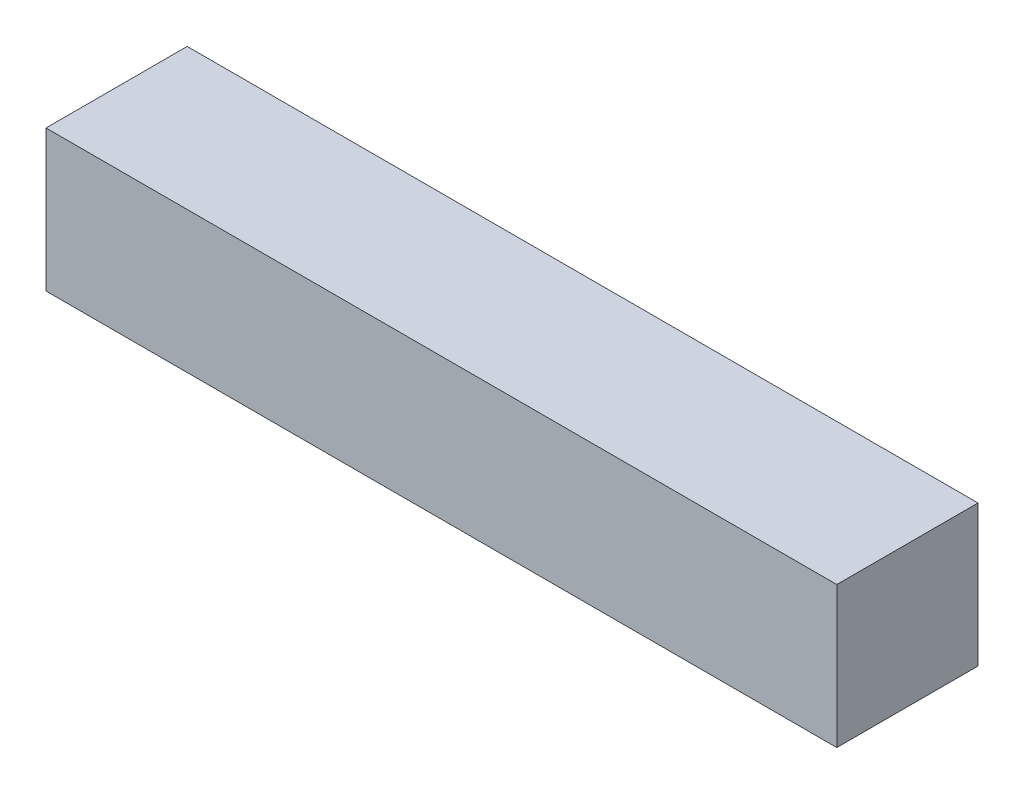
ISO-10303-21;
HEADER;
FILE_DESCRIPTION(('STEP AP214'),'2;1');
FILE_NAME('part.step','',(''),(''),'','','');
FILE_SCHEMA(('AUTOMOTIVE_DESIGN { 1 0 10303 214 1 1 1 1 }'));
ENDSEC;
DATA;
#1=APPLICATION_CONTEXT('core data for automotive mechanical design processes');
#2=APPLICATION_PROTOCOL_DEFINITION('international standard','automotive_design',2000,#1);
#3=PRODUCT_CONTEXT('',#1,'mechanical');
#4=PRODUCT('Part','Part','',(#3));
#5=PRODUCT_RELATED_PRODUCT_CATEGORY('part','',(#4));
#6=PRODUCT_DEFINITION_FORMATION('','',#4);
#7=PRODUCT_DEFINITION_CONTEXT('part definition',#1,'design');
#8=PRODUCT_DEFINITION('design','',#6,#7);
#9=PRODUCT_DEFINITION_SHAPE('','',#8);
#10=(LENGTH_UNIT() NAMED_UNIT(*) SI_UNIT(.MILLI.,.METRE.));
#11=(NAMED_UNIT(*) PLANE_ANGLE_UNIT() SI_UNIT($,.RADIAN.));
#12=(NAMED_UNIT(*) SI_UNIT($,.STERADIAN.) SOLID_ANGLE_UNIT());
#13=UNCERTAINTY_MEASURE_WITH_UNIT(LENGTH_MEASURE(1.E-05),#10,'distance_accuracy_value','');
#14=(GEOMETRIC_REPRESENTATION_CONTEXT(3) GLOBAL_UNCERTAINTY_ASSIGNED_CONTEXT((#13)) GLOBAL_UNIT_ASSIGNED_CONTEXT((#10,
#11,#12)) REPRESENTATION_CONTEXT('',''));
#15=CARTESIAN_POINT('',(0.,0.,0.));
#16=DIRECTION('',(0.,0.,1.));
#17=DIRECTION('',(1.,0.,0.));
#18=AXIS2_PLACEMENT_3D('',#15,#16,#17);
#19=CARTESIAN_POINT('',(-70.,25.,12.5));
#20=DIRECTION('',(1.,0.,0.));
#21=DIRECTION('',(0.,0.,-1.));
#22=AXIS2_PLACEMENT_3D('',#19,#20,#21);
#23=PLANE('',#22);
#24=DIRECTION('',(0.,0.,1.));
#25=VECTOR('',#24,1.);
#26=CARTESIAN_POINT('',(-70.,0.,12.5));
#27=LINE('',#26,#25);
#28=CARTESIAN_POINT('',(-70.,0.,-12.5));
#29=VERTEX_POINT('',#28);
#30=CARTESIAN_POINT('',(-70.,0.,12.5));
#31=VERTEX_POINT('',#30);
#32=EDGE_CURVE('E96',#29,#31,#27,.T.);
#33=ORIENTED_EDGE('',*,*,#32,.T.);
#34=DIRECTION('',(0.,-1.,0.));
#35=VECTOR('',#34,1.);
#36=CARTESIAN_POINT('',(-70.,25.,12.5));
#37=LINE('',#36,#35);
#38=CARTESIAN_POINT('',(-70.,25.,12.5));
#39=VERTEX_POINT('',#38);
#40=EDGE_CURVE('E11',#39,#31,#37,.T.);
#41=ORIENTED_EDGE('',*,*,#40,.F.);
#42=DIRECTION('',(0.,0.,1.));
#43=VECTOR('',#42,1.);
#44=CARTESIAN_POINT('',(-70.,25.,12.5));
#45=LINE('',#44,#43);
#46=CARTESIAN_POINT('',(-70.,25.,-12.5));
#47=VERTEX_POINT('',#46);
#48=EDGE_CURVE('E84',#47,#39,#45,.T.);
#49=ORIENTED_EDGE('',*,*,#48,.F.);
#50=DIRECTION('',(0.,-1.,0.));
#51=VECTOR('',#50,1.);
#52=CARTESIAN_POINT('',(-70.,25.,-12.5));
#53=LINE('',#52,#51);
#54=EDGE_CURVE('E92',#47,#29,#53,.T.);
#55=ORIENTED_EDGE('',*,*,#54,.T.);
#56=EDGE_LOOP('',(#33,#41,#49,#55));
#57=FACE_BOUND('',#56,.T.);
#58=ADVANCED_FACE('F33',(#57),#23,.F.);
#59=CARTESIAN_POINT('',(70.,25.,12.5));
#60=DIRECTION('',(0.,0.,-1.));
#61=DIRECTION('',(-1.,0.,0.));
#62=AXIS2_PLACEMENT_3D('',#59,#60,#61);
#63=PLANE('',#62);
#64=DIRECTION('',(1.,0.,0.));
#65=VECTOR('',#64,1.);
#66=CARTESIAN_POINT('',(70.,0.,12.5));
#67=LINE('',#66,#65);
#68=CARTESIAN_POINT('',(70.,0.,12.5));
#69=VERTEX_POINT('',#68);
#70=EDGE_CURVE('E88',#31,#69,#67,.T.);
#71=ORIENTED_EDGE('',*,*,#70,.T.);
#72=DIRECTION('',(0.,-1.,0.));
#73=VECTOR('',#72,1.);
#74=CARTESIAN_POINT('',(70.,25.,12.5));
#75=LINE('',#74,#73);
#76=CARTESIAN_POINT('',(70.,25.,12.5));
#77=VERTEX_POINT('',#76);
#78=EDGE_CURVE('E41',#77,#69,#75,.T.);
#79=ORIENTED_EDGE('',*,*,#78,.F.);
#80=DIRECTION('',(1.,0.,0.));
#81=VECTOR('',#80,1.);
#82=CARTESIAN_POINT('',(70.,25.,12.5));
#83=LINE('',#82,#81);
#84=EDGE_CURVE('E79',#39,#77,#83,.T.);
#85=ORIENTED_EDGE('',*,*,#84,.F.);
#86=ORIENTED_EDGE('',*,*,#40,.T.);
#87=EDGE_LOOP('',(#71,#79,#85,#86));
#88=FACE_BOUND('',#87,.T.);
#89=ADVANCED_FACE('F87',(#88),#63,.F.);
#90=CARTESIAN_POINT('',(70.,25.,12.5));
#91=DIRECTION('',(-1.,0.,0.));
#92=DIRECTION('',(0.,0.,1.));
#93=AXIS2_PLACEMENT_3D('',#90,#91,#92);
#94=PLANE('',#93);
#95=DIRECTION('',(0.,0.,-1.));
#96=VECTOR('',#95,1.);
#97=CARTESIAN_POINT('',(70.,0.,12.5));
#98=LINE('',#97,#96);
#99=CARTESIAN_POINT('',(70.,0.,-12.5));
#100=VERTEX_POINT('',#99);
#101=EDGE_CURVE('E66',#69,#100,#98,.T.);
#102=ORIENTED_EDGE('',*,*,#101,.T.);
#103=DIRECTION('',(0.,-1.,0.));
#104=VECTOR('',#103,1.);
#105=CARTESIAN_POINT('',(70.,25.,-12.5));
#106=LINE('',#105,#104);
#107=CARTESIAN_POINT('',(70.,25.,-12.5));
#108=VERTEX_POINT('',#107);
#109=EDGE_CURVE('E89',#108,#100,#106,.T.);
#110=ORIENTED_EDGE('',*,*,#109,.F.);
#111=DIRECTION('',(0.,0.,-1.));
#112=VECTOR('',#111,1.);
#113=CARTESIAN_POINT('',(70.,25.,12.5));
#114=LINE('',#113,#112);
#115=EDGE_CURVE('E82',#77,#108,#114,.T.);
#116=ORIENTED_EDGE('',*,*,#115,.F.);
#117=ORIENTED_EDGE('',*,*,#78,.T.);
#118=EDGE_LOOP('',(#102,#110,#116,#117));
#119=FACE_BOUND('',#118,.T.);
#120=ADVANCED_FACE('F90',(#119),#94,.F.);
#121=CARTESIAN_POINT('',(70.,25.,-12.5));
#122=DIRECTION('',(0.,0.,1.));
#123=DIRECTION('',(1.,0.,0.));
#124=AXIS2_PLACEMENT_3D('',#121,#122,#123);
#125=PLANE('',#124);
#126=DIRECTION('',(-1.,0.,0.));
#127=VECTOR('',#126,1.);
#128=CARTESIAN_POINT('',(70.,0.,-12.5));
#129=LINE('',#128,#127);
#130=EDGE_CURVE('E72',#100,#29,#129,.T.);
#131=ORIENTED_EDGE('',*,*,#130,.T.);
#132=ORIENTED_EDGE('',*,*,#54,.F.);
#133=DIRECTION('',(-1.,0.,0.));
#134=VECTOR('',#133,1.);
#135=CARTESIAN_POINT('',(70.,25.,-12.5));
#136=LINE('',#135,#134);
#137=EDGE_CURVE('E49',#108,#47,#136,.T.);
#138=ORIENTED_EDGE('',*,*,#137,.F.);
#139=ORIENTED_EDGE('',*,*,#109,.T.);
#140=EDGE_LOOP('',(#131,#132,#138,#139));
#141=FACE_BOUND('',#140,.T.);
#142=ADVANCED_FACE('F103',(#141),#125,.F.);
#143=CARTESIAN_POINT('',(0.,25.,0.));
#144=DIRECTION('',(0.,1.,0.));
#145=DIRECTION('',(0.,0.,1.));
#146=AXIS2_PLACEMENT_3D('',#143,#144,#145);
#147=PLANE('',#146);
#148=ORIENTED_EDGE('',*,*,#48,.T.);
#149=ORIENTED_EDGE('',*,*,#84,.T.);
#150=ORIENTED_EDGE('',*,*,#115,.T.);
#151=ORIENTED_EDGE('',*,*,#137,.T.);
#152=EDGE_LOOP('',(#148,#149,#150,#151));
#153=FACE_BOUND('',#152,.T.);
#154=ADVANCED_FACE('F80',(#153),#147,.T.);
#155=CARTESIAN_POINT('',(0.,0.,0.));
#156=DIRECTION('',(0.,1.,0.));
#157=DIRECTION('',(0.,0.,1.));
#158=AXIS2_PLACEMENT_3D('',#155,#156,#157);
#159=PLANE('',#158);
#160=ORIENTED_EDGE('',*,*,#32,.F.);
#161=ORIENTED_EDGE('',*,*,#130,.F.);
#162=ORIENTED_EDGE('',*,*,#101,.F.);
#163=ORIENTED_EDGE('',*,*,#70,.F.);
#164=EDGE_LOOP('',(#160,#161,#162,#163));
#165=FACE_BOUND('',#164,.T.);
#166=ADVANCED_FACE('F106',(#165),#159,.F.);
#167=CLOSED_SHELL('',(#58,#89,#120,#142,#154,#166));
#168=MANIFOLD_SOLID_BREP('B2',#167);
#169=ADVANCED_BREP_SHAPE_REPRESENTATION('',(#18,#168),#14);
#170=SHAPE_DEFINITION_REPRESENTATION(#9,#169);
ENDSEC;
END-ISO-10303-21;
